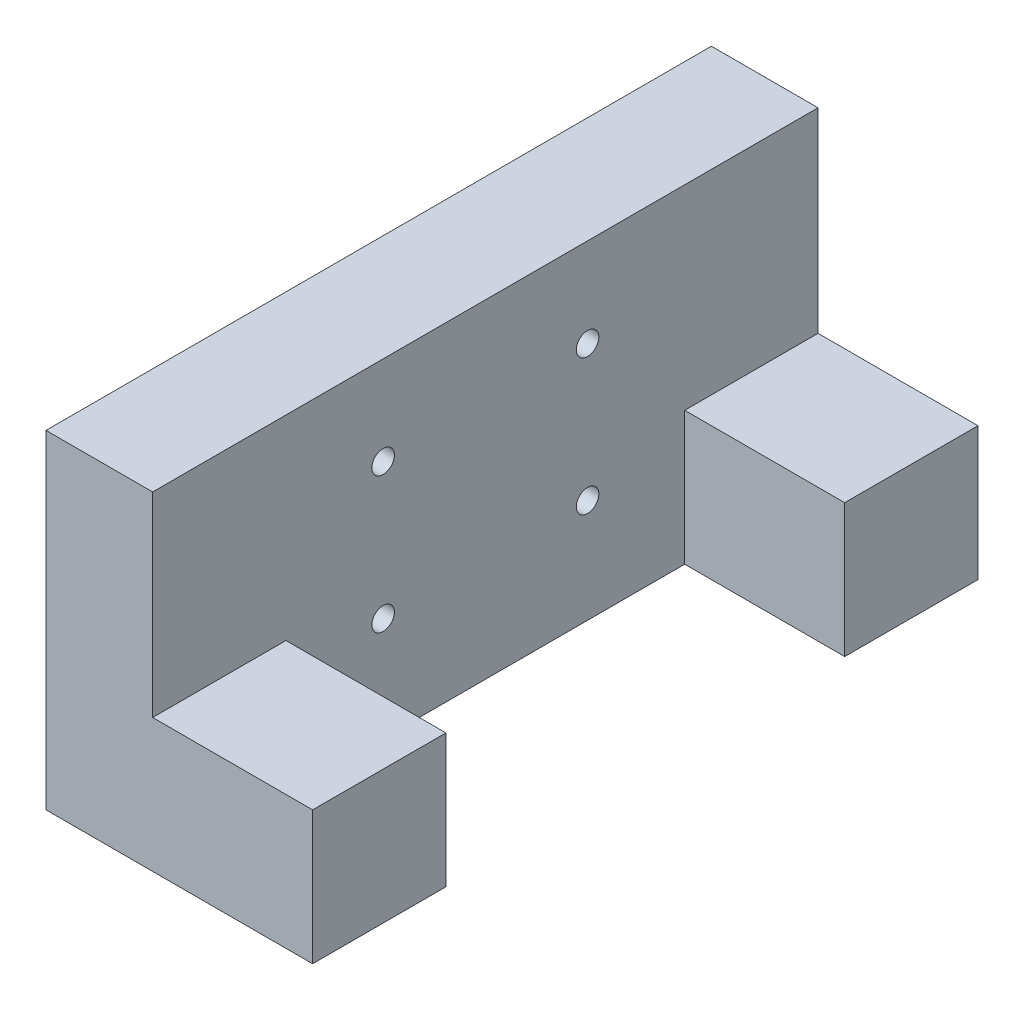
ISO-10303-21;
HEADER;
FILE_DESCRIPTION(('STEP AP214'),'2;1');
FILE_NAME('part.step','',(''),(''),'','','');
FILE_SCHEMA(('AUTOMOTIVE_DESIGN { 1 0 10303 214 1 1 1 1 }'));
ENDSEC;
DATA;
#1=APPLICATION_CONTEXT('core data for automotive mechanical design processes');
#2=APPLICATION_PROTOCOL_DEFINITION('international standard','automotive_design',2000,#1);
#3=PRODUCT_CONTEXT('',#1,'mechanical');
#4=PRODUCT('Part','Part','',(#3));
#5=PRODUCT_RELATED_PRODUCT_CATEGORY('part','',(#4));
#6=PRODUCT_DEFINITION_FORMATION('','',#4);
#7=PRODUCT_DEFINITION_CONTEXT('part definition',#1,'design');
#8=PRODUCT_DEFINITION('design','',#6,#7);
#9=PRODUCT_DEFINITION_SHAPE('','',#8);
#10=(LENGTH_UNIT() NAMED_UNIT(*) SI_UNIT(.MILLI.,.METRE.));
#11=(NAMED_UNIT(*) PLANE_ANGLE_UNIT() SI_UNIT($,.RADIAN.));
#12=(NAMED_UNIT(*) SI_UNIT($,.STERADIAN.) SOLID_ANGLE_UNIT());
#13=UNCERTAINTY_MEASURE_WITH_UNIT(LENGTH_MEASURE(1.E-05),#10,'distance_accuracy_value','');
#14=(GEOMETRIC_REPRESENTATION_CONTEXT(3) GLOBAL_UNCERTAINTY_ASSIGNED_CONTEXT((#13)) GLOBAL_UNIT_ASSIGNED_CONTEXT((#10,
#11,#12)) REPRESENTATION_CONTEXT('',''));
#15=CARTESIAN_POINT('',(0.,0.,0.));
#16=DIRECTION('',(0.,0.,1.));
#17=DIRECTION('',(1.,0.,0.));
#18=AXIS2_PLACEMENT_3D('',#15,#16,#17);
#19=CARTESIAN_POINT('',(35.0764508478614,0.,0.));
#20=DIRECTION('',(-1.,0.,0.));
#21=DIRECTION('',(0.,-1.,0.));
#22=AXIS2_PLACEMENT_3D('',#19,#20,#21);
#23=PLANE('',#22);
#24=CARTESIAN_POINT('',(35.0764508478611,-92.7759999999556,-271.868893693745));
#25=DIRECTION('',(1.,0.,0.));
#26=DIRECTION('',(0.,1.,0.));
#27=AXIS2_PLACEMENT_3D('',#24,#25,#26);
#28=CIRCLE('',#27,1.26999999999998);
#29=CARTESIAN_POINT('',(35.0764508478611,-91.5059999999556,-271.868893693745));
#30=VERTEX_POINT('',#29);
#31=EDGE_CURVE('E453',#30,#30,#28,.T.);
#32=ORIENTED_EDGE('',*,*,#31,.F.);
#33=EDGE_LOOP('',(#32));
#34=FACE_BOUND('',#33,.T.);
#35=CARTESIAN_POINT('',(35.076450847861,-77.4759999999556,-294.868893693745));
#36=DIRECTION('',(1.,0.,0.));
#37=DIRECTION('',(0.,1.,0.));
#38=AXIS2_PLACEMENT_3D('',#35,#36,#37);
#39=CIRCLE('',#38,1.26999999999998);
#40=CARTESIAN_POINT('',(35.076450847861,-76.2059999999556,-294.868893693745));
#41=VERTEX_POINT('',#40);
#42=EDGE_CURVE('E459',#41,#41,#39,.T.);
#43=ORIENTED_EDGE('',*,*,#42,.F.);
#44=EDGE_LOOP('',(#43));
#45=FACE_BOUND('',#44,.T.);
#46=CARTESIAN_POINT('',(35.076450847861,-92.7759999999556,-294.868893693745));
#47=DIRECTION('',(1.,0.,0.));
#48=DIRECTION('',(0.,1.,0.));
#49=AXIS2_PLACEMENT_3D('',#46,#47,#48);
#50=CIRCLE('',#49,1.26999999999998);
#51=CARTESIAN_POINT('',(35.076450847861,-91.5059999999556,-294.868893693745));
#52=VERTEX_POINT('',#51);
#53=EDGE_CURVE('E470',#52,#52,#50,.T.);
#54=ORIENTED_EDGE('',*,*,#53,.F.);
#55=EDGE_LOOP('',(#54));
#56=FACE_BOUND('',#55,.T.);
#57=CARTESIAN_POINT('',(35.076450847861,-77.4759999999556,-271.868893693745));
#58=DIRECTION('',(1.,0.,0.));
#59=DIRECTION('',(0.,1.,0.));
#60=AXIS2_PLACEMENT_3D('',#57,#58,#59);
#61=CIRCLE('',#60,1.26999999999998);
#62=CARTESIAN_POINT('',(35.076450847861,-76.2059999999556,-271.868893693745));
#63=VERTEX_POINT('',#62);
#64=EDGE_CURVE('E454',#63,#63,#61,.T.);
#65=ORIENTED_EDGE('',*,*,#64,.F.);
#66=EDGE_LOOP('',(#65));
#67=FACE_BOUND('',#66,.T.);
#68=DIRECTION('',(0.,0.,1.));
#69=VECTOR('',#68,1.);
#70=CARTESIAN_POINT('',(35.076450847861,-89.4560056897918,-320.804230830708));
#71=LINE('',#70,#69);
#72=CARTESIAN_POINT('',(35.076450847861,-89.4560056897918,-320.804230830708));
#73=VERTEX_POINT('',#72);
#74=CARTESIAN_POINT('',(35.076450847861,-89.4560056897918,-305.804230830708));
#75=VERTEX_POINT('',#74);
#76=EDGE_CURVE('E115',#73,#75,#71,.T.);
#77=ORIENTED_EDGE('',*,*,#76,.F.);
#78=DIRECTION('',(0.,-1.,0.));
#79=VECTOR('',#78,1.);
#80=CARTESIAN_POINT('',(35.0764508478609,-67.4759999999556,-320.804230830708));
#81=LINE('',#80,#79);
#82=CARTESIAN_POINT('',(35.0764508478609,-67.4759999999556,-320.804230830708));
#83=VERTEX_POINT('',#82);
#84=EDGE_CURVE('E182',#83,#73,#81,.T.);
#85=ORIENTED_EDGE('',*,*,#84,.F.);
#86=DIRECTION('',(0.,0.,-1.));
#87=VECTOR('',#86,1.);
#88=CARTESIAN_POINT('',(35.0764508478609,-67.4759999999556,-320.804230830708));
#89=LINE('',#88,#87);
#90=CARTESIAN_POINT('',(35.076450847861,-67.4759999999556,-245.933751171901));
#91=VERTEX_POINT('',#90);
#92=EDGE_CURVE('E180',#91,#83,#89,.T.);
#93=ORIENTED_EDGE('',*,*,#92,.F.);
#94=DIRECTION('',(0.,1.,0.));
#95=VECTOR('',#94,1.);
#96=CARTESIAN_POINT('',(35.076450847861,-67.4759999999556,-245.933751171901));
#97=LINE('',#96,#95);
#98=CARTESIAN_POINT('',(35.0764508478611,-89.4560056897918,-245.933751171901));
#99=VERTEX_POINT('',#98);
#100=EDGE_CURVE('E168',#99,#91,#97,.T.);
#101=ORIENTED_EDGE('',*,*,#100,.F.);
#102=DIRECTION('',(0.,0.,1.));
#103=VECTOR('',#102,1.);
#104=CARTESIAN_POINT('',(35.0764508478611,-89.4560056897918,-245.933751171901));
#105=LINE('',#104,#103);
#106=CARTESIAN_POINT('',(35.0764508478611,-89.4560056897918,-260.933751171901));
#107=VERTEX_POINT('',#106);
#108=EDGE_CURVE('E149',#107,#99,#105,.T.);
#109=ORIENTED_EDGE('',*,*,#108,.F.);
#110=DIRECTION('',(0.,1.,0.));
#111=VECTOR('',#110,1.);
#112=CARTESIAN_POINT('',(35.0764508478611,-104.456005689792,-260.933751171901));
#113=LINE('',#112,#111);
#114=CARTESIAN_POINT('',(35.0764508478611,-104.456005689792,-260.933751171901));
#115=VERTEX_POINT('',#114);
#116=EDGE_CURVE('E126',#115,#107,#113,.T.);
#117=ORIENTED_EDGE('',*,*,#116,.F.);
#118=DIRECTION('',(0.,0.,1.));
#119=VECTOR('',#118,1.);
#120=CARTESIAN_POINT('',(35.076450847861,-104.456005689792,-320.804230830708));
#121=LINE('',#120,#119);
#122=CARTESIAN_POINT('',(35.076450847861,-104.456005689792,-305.804230830708));
#123=VERTEX_POINT('',#122);
#124=EDGE_CURVE('E57',#123,#115,#121,.T.);
#125=ORIENTED_EDGE('',*,*,#124,.F.);
#126=DIRECTION('',(0.,-1.,0.));
#127=VECTOR('',#126,1.);
#128=CARTESIAN_POINT('',(35.076450847861,-104.456005689792,-305.804230830708));
#129=LINE('',#128,#127);
#130=EDGE_CURVE('E127',#75,#123,#129,.T.);
#131=ORIENTED_EDGE('',*,*,#130,.F.);
#132=EDGE_LOOP('',(#77,#85,#93,#101,#109,#117,#125,#131));
#133=FACE_BOUND('',#132,.T.);
#134=ADVANCED_FACE('F37',(#34,#45,#56,#67,#133),#23,.F.);
#135=CARTESIAN_POINT('',(23.076450847861,-67.4759999999556,-245.933751171901));
#136=DIRECTION('',(0.,0.,-1.));
#137=DIRECTION('',(-1.,0.,0.));
#138=AXIS2_PLACEMENT_3D('',#135,#136,#137);
#139=PLANE('',#138);
#140=DIRECTION('',(1.,0.,0.));
#141=VECTOR('',#140,1.);
#142=CARTESIAN_POINT('',(23.0764508478611,-104.456005689792,-245.933751171901));
#143=LINE('',#142,#141);
#144=CARTESIAN_POINT('',(23.0764508478611,-104.456005689792,-245.933751171901));
#145=VERTEX_POINT('',#144);
#146=CARTESIAN_POINT('',(53.0764508478611,-104.456005689792,-245.933751171901));
#147=VERTEX_POINT('',#146);
#148=EDGE_CURVE('E178',#145,#147,#143,.T.);
#149=ORIENTED_EDGE('',*,*,#148,.T.);
#150=DIRECTION('',(0.,-1.,0.));
#151=VECTOR('',#150,1.);
#152=CARTESIAN_POINT('',(53.0764508478611,-104.456005689792,-245.933751171901));
#153=LINE('',#152,#151);
#154=CARTESIAN_POINT('',(53.0764508478611,-89.4560056897918,-245.933751171901));
#155=VERTEX_POINT('',#154);
#156=EDGE_CURVE('E145',#155,#147,#153,.T.);
#157=ORIENTED_EDGE('',*,*,#156,.F.);
#158=DIRECTION('',(-1.,0.,0.));
#159=VECTOR('',#158,1.);
#160=CARTESIAN_POINT('',(53.0764508478611,-89.4560056897918,-245.933751171901));
#161=LINE('',#160,#159);
#162=EDGE_CURVE('E155',#155,#99,#161,.T.);
#163=ORIENTED_EDGE('',*,*,#162,.T.);
#164=ORIENTED_EDGE('',*,*,#100,.T.);
#165=DIRECTION('',(1.,0.,0.));
#166=VECTOR('',#165,1.);
#167=CARTESIAN_POINT('',(23.076450847861,-67.4759999999556,-245.933751171901));
#168=LINE('',#167,#166);
#169=CARTESIAN_POINT('',(23.076450847861,-67.4759999999556,-245.933751171901));
#170=VERTEX_POINT('',#169);
#171=EDGE_CURVE('E11',#170,#91,#168,.T.);
#172=ORIENTED_EDGE('',*,*,#171,.F.);
#173=DIRECTION('',(0.,1.,0.));
#174=VECTOR('',#173,1.);
#175=CARTESIAN_POINT('',(23.076450847861,-67.4759999999556,-245.933751171901));
#176=LINE('',#175,#174);
#177=EDGE_CURVE('E169',#145,#170,#176,.T.);
#178=ORIENTED_EDGE('',*,*,#177,.F.);
#179=EDGE_LOOP('',(#149,#157,#163,#164,#172,#178));
#180=FACE_BOUND('',#179,.T.);
#181=ADVANCED_FACE('F39',(#180),#139,.F.);
#182=CARTESIAN_POINT('',(23.0764508478609,-67.4759999999556,-320.804230830708));
#183=DIRECTION('',(0.,-1.,0.));
#184=DIRECTION('',(1.,0.,0.));
#185=AXIS2_PLACEMENT_3D('',#182,#183,#184);
#186=PLANE('',#185);
#187=ORIENTED_EDGE('',*,*,#92,.T.);
#188=DIRECTION('',(1.,0.,0.));
#189=VECTOR('',#188,1.);
#190=CARTESIAN_POINT('',(23.0764508478609,-67.4759999999556,-320.804230830708));
#191=LINE('',#190,#189);
#192=CARTESIAN_POINT('',(23.0764508478609,-67.4759999999556,-320.804230830708));
#193=VERTEX_POINT('',#192);
#194=EDGE_CURVE('E45',#193,#83,#191,.T.);
#195=ORIENTED_EDGE('',*,*,#194,.F.);
#196=DIRECTION('',(0.,0.,-1.));
#197=VECTOR('',#196,1.);
#198=CARTESIAN_POINT('',(23.0764508478609,-67.4759999999556,-320.804230830708));
#199=LINE('',#198,#197);
#200=EDGE_CURVE('E172',#170,#193,#199,.T.);
#201=ORIENTED_EDGE('',*,*,#200,.F.);
#202=ORIENTED_EDGE('',*,*,#171,.T.);
#203=EDGE_LOOP('',(#187,#195,#201,#202));
#204=FACE_BOUND('',#203,.T.);
#205=ADVANCED_FACE('F196',(#204),#186,.F.);
#206=CARTESIAN_POINT('',(23.0764508478609,-67.4759999999556,-320.804230830708));
#207=DIRECTION('',(0.,0.,1.));
#208=DIRECTION('',(1.,0.,0.));
#209=AXIS2_PLACEMENT_3D('',#206,#207,#208);
#210=PLANE('',#209);
#211=ORIENTED_EDGE('',*,*,#84,.T.);
#212=DIRECTION('',(-1.,0.,0.));
#213=VECTOR('',#212,1.);
#214=CARTESIAN_POINT('',(53.076450847861,-89.4560056897918,-320.804230830708));
#215=LINE('',#214,#213);
#216=CARTESIAN_POINT('',(53.076450847861,-89.4560056897918,-320.804230830708));
#217=VERTEX_POINT('',#216);
#218=EDGE_CURVE('E121',#217,#73,#215,.T.);
#219=ORIENTED_EDGE('',*,*,#218,.F.);
#220=DIRECTION('',(0.,1.,0.));
#221=VECTOR('',#220,1.);
#222=CARTESIAN_POINT('',(53.076450847861,-104.456005689792,-320.804230830708));
#223=LINE('',#222,#221);
#224=CARTESIAN_POINT('',(53.076450847861,-104.456005689792,-320.804230830708));
#225=VERTEX_POINT('',#224);
#226=EDGE_CURVE('E133',#225,#217,#223,.T.);
#227=ORIENTED_EDGE('',*,*,#226,.F.);
#228=DIRECTION('',(1.,0.,0.));
#229=VECTOR('',#228,1.);
#230=CARTESIAN_POINT('',(23.076450847861,-104.456005689792,-320.804230830708));
#231=LINE('',#230,#229);
#232=CARTESIAN_POINT('',(23.076450847861,-104.456005689792,-320.804230830708));
#233=VERTEX_POINT('',#232);
#234=EDGE_CURVE('E186',#233,#225,#231,.T.);
#235=ORIENTED_EDGE('',*,*,#234,.F.);
#236=DIRECTION('',(0.,-1.,0.));
#237=VECTOR('',#236,1.);
#238=CARTESIAN_POINT('',(23.0764508478609,-67.4759999999556,-320.804230830708));
#239=LINE('',#238,#237);
#240=EDGE_CURVE('E174',#193,#233,#239,.T.);
#241=ORIENTED_EDGE('',*,*,#240,.F.);
#242=ORIENTED_EDGE('',*,*,#194,.T.);
#243=EDGE_LOOP('',(#211,#219,#227,#235,#241,#242));
#244=FACE_BOUND('',#243,.T.);
#245=ADVANCED_FACE('F191',(#244),#210,.F.);
#246=CARTESIAN_POINT('',(23.076450847861,-104.456005689792,-320.804230830708));
#247=DIRECTION('',(0.,1.,0.));
#248=DIRECTION('',(-1.,0.,0.));
#249=AXIS2_PLACEMENT_3D('',#246,#247,#248);
#250=PLANE('',#249);
#251=CARTESIAN_POINT('',(46.0264508482652,-104.456005689792,-253.724999999956));
#252=DIRECTION('',(0.,-1.,0.));
#253=DIRECTION('',(1.,0.,0.));
#254=AXIS2_PLACEMENT_3D('',#251,#252,#253);
#255=CIRCLE('',#254,4.07500000002037);
#256=CARTESIAN_POINT('',(50.1014508482855,-104.456005689792,-253.724999999956));
#257=VERTEX_POINT('',#256);
#258=EDGE_CURVE('E477',#257,#257,#255,.T.);
#259=ORIENTED_EDGE('',*,*,#258,.F.);
#260=EDGE_LOOP('',(#259));
#261=FACE_BOUND('',#260,.T.);
#262=CARTESIAN_POINT('',(46.0264508482652,-104.456005689792,-313.012982002653));
#263=DIRECTION('',(0.,-1.,0.));
#264=DIRECTION('',(-1.,0.,0.));
#265=AXIS2_PLACEMENT_3D('',#262,#263,#264);
#266=CIRCLE('',#265,4.07500000004585);
#267=CARTESIAN_POINT('',(41.9514508482193,-104.456005689792,-313.012982002653));
#268=VERTEX_POINT('',#267);
#269=EDGE_CURVE('E480',#268,#268,#266,.T.);
#270=ORIENTED_EDGE('',*,*,#269,.F.);
#271=EDGE_LOOP('',(#270));
#272=FACE_BOUND('',#271,.T.);
#273=ORIENTED_EDGE('',*,*,#234,.T.);
#274=DIRECTION('',(0.,0.,-1.));
#275=VECTOR('',#274,1.);
#276=CARTESIAN_POINT('',(53.076450847861,-104.456005689792,-320.804230830708));
#277=LINE('',#276,#275);
#278=CARTESIAN_POINT('',(53.076450847861,-104.456005689792,-305.804230830708));
#279=VERTEX_POINT('',#278);
#280=EDGE_CURVE('E140',#279,#225,#277,.T.);
#281=ORIENTED_EDGE('',*,*,#280,.F.);
#282=DIRECTION('',(-1.,0.,0.));
#283=VECTOR('',#282,1.);
#284=CARTESIAN_POINT('',(53.076450847861,-104.456005689792,-305.804230830708));
#285=LINE('',#284,#283);
#286=EDGE_CURVE('E52',#279,#123,#285,.T.);
#287=ORIENTED_EDGE('',*,*,#286,.T.);
#288=ORIENTED_EDGE('',*,*,#124,.T.);
#289=DIRECTION('',(-1.,0.,0.));
#290=VECTOR('',#289,1.);
#291=CARTESIAN_POINT('',(53.0764508478611,-104.456005689792,-260.933751171901));
#292=LINE('',#291,#290);
#293=CARTESIAN_POINT('',(53.0764508478611,-104.456005689792,-260.933751171901));
#294=VERTEX_POINT('',#293);
#295=EDGE_CURVE('E165',#294,#115,#292,.T.);
#296=ORIENTED_EDGE('',*,*,#295,.F.);
#297=DIRECTION('',(0.,0.,-1.));
#298=VECTOR('',#297,1.);
#299=CARTESIAN_POINT('',(53.0764508478611,-104.456005689792,-245.933751171901));
#300=LINE('',#299,#298);
#301=EDGE_CURVE('E148',#147,#294,#300,.T.);
#302=ORIENTED_EDGE('',*,*,#301,.F.);
#303=ORIENTED_EDGE('',*,*,#148,.F.);
#304=DIRECTION('',(0.,0.,1.));
#305=VECTOR('',#304,1.);
#306=CARTESIAN_POINT('',(23.076450847861,-104.456005689792,-320.804230830708));
#307=LINE('',#306,#305);
#308=EDGE_CURVE('E176',#233,#145,#307,.T.);
#309=ORIENTED_EDGE('',*,*,#308,.F.);
#310=EDGE_LOOP('',(#273,#281,#287,#288,#296,#302,#303,#309));
#311=FACE_BOUND('',#310,.T.);
#312=ADVANCED_FACE('F209',(#261,#272,#311),#250,.F.);
#313=CARTESIAN_POINT('',(23.0764508478614,0.,0.));
#314=DIRECTION('',(-1.,0.,0.));
#315=DIRECTION('',(0.,-1.,0.));
#316=AXIS2_PLACEMENT_3D('',#313,#314,#315);
#317=PLANE('',#316);
#318=CARTESIAN_POINT('',(23.0764508478608,-92.7759999999556,-271.868893693745));
#319=DIRECTION('',(1.,0.,0.));
#320=DIRECTION('',(0.,1.,0.));
#321=AXIS2_PLACEMENT_3D('',#318,#319,#320);
#322=CIRCLE('',#321,1.26999999999998);
#323=CARTESIAN_POINT('',(23.0764508478608,-91.5059999999556,-271.868893693745));
#324=VERTEX_POINT('',#323);
#325=EDGE_CURVE('E451',#324,#324,#322,.T.);
#326=ORIENTED_EDGE('',*,*,#325,.T.);
#327=EDGE_LOOP('',(#326));
#328=FACE_BOUND('',#327,.T.);
#329=CARTESIAN_POINT('',(23.0764508478608,-77.4759999999556,-294.868893693745));
#330=DIRECTION('',(1.,0.,0.));
#331=DIRECTION('',(0.,1.,0.));
#332=AXIS2_PLACEMENT_3D('',#329,#330,#331);
#333=CIRCLE('',#332,1.26999999999998);
#334=CARTESIAN_POINT('',(23.0764508478607,-76.2059999999556,-294.868893693745));
#335=VERTEX_POINT('',#334);
#336=EDGE_CURVE('E467',#335,#335,#333,.T.);
#337=ORIENTED_EDGE('',*,*,#336,.T.);
#338=EDGE_LOOP('',(#337));
#339=FACE_BOUND('',#338,.T.);
#340=CARTESIAN_POINT('',(23.0764508478608,-92.7759999999556,-294.868893693745));
#341=DIRECTION('',(1.,0.,0.));
#342=DIRECTION('',(0.,1.,0.));
#343=AXIS2_PLACEMENT_3D('',#340,#341,#342);
#344=CIRCLE('',#343,1.26999999999998);
#345=CARTESIAN_POINT('',(23.0764508478608,-91.5059999999556,-294.868893693745));
#346=VERTEX_POINT('',#345);
#347=EDGE_CURVE('E462',#346,#346,#344,.T.);
#348=ORIENTED_EDGE('',*,*,#347,.T.);
#349=EDGE_LOOP('',(#348));
#350=FACE_BOUND('',#349,.T.);
#351=CARTESIAN_POINT('',(23.0764508478608,-77.4759999999556,-271.868893693745));
#352=DIRECTION('',(1.,0.,0.));
#353=DIRECTION('',(0.,1.,0.));
#354=AXIS2_PLACEMENT_3D('',#351,#352,#353);
#355=CIRCLE('',#354,1.26999999999998);
#356=CARTESIAN_POINT('',(23.0764508478608,-76.2059999999556,-271.868893693745));
#357=VERTEX_POINT('',#356);
#358=EDGE_CURVE('E457',#357,#357,#355,.T.);
#359=ORIENTED_EDGE('',*,*,#358,.T.);
#360=EDGE_LOOP('',(#359));
#361=FACE_BOUND('',#360,.T.);
#362=ORIENTED_EDGE('',*,*,#177,.T.);
#363=ORIENTED_EDGE('',*,*,#200,.T.);
#364=ORIENTED_EDGE('',*,*,#240,.T.);
#365=ORIENTED_EDGE('',*,*,#308,.T.);
#366=EDGE_LOOP('',(#362,#363,#364,#365));
#367=FACE_BOUND('',#366,.T.);
#368=ADVANCED_FACE('F233',(#328,#339,#350,#361,#367),#317,.T.);
#369=CARTESIAN_POINT('',(53.0764508478611,-104.456005689792,-260.933751171901));
#370=DIRECTION('',(0.,0.,1.));
#371=DIRECTION('',(1.,0.,0.));
#372=AXIS2_PLACEMENT_3D('',#369,#370,#371);
#373=PLANE('',#372);
#374=ORIENTED_EDGE('',*,*,#116,.T.);
#375=DIRECTION('',(-1.,0.,0.));
#376=VECTOR('',#375,1.);
#377=CARTESIAN_POINT('',(53.0764508478611,-89.4560056897918,-260.933751171901));
#378=LINE('',#377,#376);
#379=CARTESIAN_POINT('',(53.0764508478611,-89.4560056897918,-260.933751171901));
#380=VERTEX_POINT('',#379);
#381=EDGE_CURVE('E162',#380,#107,#378,.T.);
#382=ORIENTED_EDGE('',*,*,#381,.F.);
#383=DIRECTION('',(0.,1.,0.));
#384=VECTOR('',#383,1.);
#385=CARTESIAN_POINT('',(53.0764508478611,-104.456005689792,-260.933751171901));
#386=LINE('',#385,#384);
#387=EDGE_CURVE('E151',#294,#380,#386,.T.);
#388=ORIENTED_EDGE('',*,*,#387,.F.);
#389=ORIENTED_EDGE('',*,*,#295,.T.);
#390=EDGE_LOOP('',(#374,#382,#388,#389));
#391=FACE_BOUND('',#390,.T.);
#392=ADVANCED_FACE('F206',(#391),#373,.F.);
#393=CARTESIAN_POINT('',(53.0764508478611,-89.4560056897918,-245.933751171901));
#394=DIRECTION('',(0.,-1.,0.));
#395=DIRECTION('',(1.,0.,0.));
#396=AXIS2_PLACEMENT_3D('',#393,#394,#395);
#397=PLANE('',#396);
#398=ORIENTED_EDGE('',*,*,#108,.T.);
#399=ORIENTED_EDGE('',*,*,#162,.F.);
#400=DIRECTION('',(0.,0.,1.));
#401=VECTOR('',#400,1.);
#402=CARTESIAN_POINT('',(53.0764508478611,-89.4560056897918,-245.933751171901));
#403=LINE('',#402,#401);
#404=EDGE_CURVE('E153',#380,#155,#403,.T.);
#405=ORIENTED_EDGE('',*,*,#404,.F.);
#406=ORIENTED_EDGE('',*,*,#381,.T.);
#407=EDGE_LOOP('',(#398,#399,#405,#406));
#408=FACE_BOUND('',#407,.T.);
#409=ADVANCED_FACE('F203',(#408),#397,.F.);
#410=CARTESIAN_POINT('',(53.0764508478613,1.20022975107335E-13,0.));
#411=DIRECTION('',(-1.,0.,0.));
#412=DIRECTION('',(0.,-1.,0.));
#413=AXIS2_PLACEMENT_3D('',#410,#411,#412);
#414=PLANE('',#413);
#415=ORIENTED_EDGE('',*,*,#156,.T.);
#416=ORIENTED_EDGE('',*,*,#301,.T.);
#417=ORIENTED_EDGE('',*,*,#387,.T.);
#418=ORIENTED_EDGE('',*,*,#404,.T.);
#419=EDGE_LOOP('',(#415,#416,#417,#418));
#420=FACE_BOUND('',#419,.T.);
#421=ADVANCED_FACE('F213',(#420),#414,.F.);
#422=CARTESIAN_POINT('',(53.076450847861,-89.4560056897918,-320.804230830708));
#423=DIRECTION('',(0.,-1.,0.));
#424=DIRECTION('',(1.,0.,0.));
#425=AXIS2_PLACEMENT_3D('',#422,#423,#424);
#426=PLANE('',#425);
#427=ORIENTED_EDGE('',*,*,#76,.T.);
#428=DIRECTION('',(-1.,0.,0.));
#429=VECTOR('',#428,1.);
#430=CARTESIAN_POINT('',(53.076450847861,-89.4560056897918,-305.804230830708));
#431=LINE('',#430,#429);
#432=CARTESIAN_POINT('',(53.076450847861,-89.4560056897918,-305.804230830708));
#433=VERTEX_POINT('',#432);
#434=EDGE_CURVE('E118',#433,#75,#431,.T.);
#435=ORIENTED_EDGE('',*,*,#434,.F.);
#436=DIRECTION('',(0.,0.,1.));
#437=VECTOR('',#436,1.);
#438=CARTESIAN_POINT('',(53.076450847861,-89.4560056897918,-320.804230830708));
#439=LINE('',#438,#437);
#440=EDGE_CURVE('E136',#217,#433,#439,.T.);
#441=ORIENTED_EDGE('',*,*,#440,.F.);
#442=ORIENTED_EDGE('',*,*,#218,.T.);
#443=EDGE_LOOP('',(#427,#435,#441,#442));
#444=FACE_BOUND('',#443,.T.);
#445=ADVANCED_FACE('F117',(#444),#426,.F.);
#446=CARTESIAN_POINT('',(53.076450847861,-104.456005689792,-305.804230830708));
#447=DIRECTION('',(0.,0.,-1.));
#448=DIRECTION('',(-1.,0.,0.));
#449=AXIS2_PLACEMENT_3D('',#446,#447,#448);
#450=PLANE('',#449);
#451=ORIENTED_EDGE('',*,*,#130,.T.);
#452=ORIENTED_EDGE('',*,*,#286,.F.);
#453=DIRECTION('',(0.,-1.,0.));
#454=VECTOR('',#453,1.);
#455=CARTESIAN_POINT('',(53.076450847861,-104.456005689792,-305.804230830708));
#456=LINE('',#455,#454);
#457=EDGE_CURVE('E131',#433,#279,#456,.T.);
#458=ORIENTED_EDGE('',*,*,#457,.F.);
#459=ORIENTED_EDGE('',*,*,#434,.T.);
#460=EDGE_LOOP('',(#451,#452,#458,#459));
#461=FACE_BOUND('',#460,.T.);
#462=ADVANCED_FACE('F130',(#461),#450,.F.);
#463=CARTESIAN_POINT('',(53.0764508478613,1.20022975107335E-13,0.));
#464=DIRECTION('',(1.,0.,0.));
#465=DIRECTION('',(0.,1.,0.));
#466=AXIS2_PLACEMENT_3D('',#463,#464,#465);
#467=PLANE('',#466);
#468=ORIENTED_EDGE('',*,*,#226,.T.);
#469=ORIENTED_EDGE('',*,*,#440,.T.);
#470=ORIENTED_EDGE('',*,*,#457,.T.);
#471=ORIENTED_EDGE('',*,*,#280,.T.);
#472=EDGE_LOOP('',(#468,#469,#470,#471));
#473=FACE_BOUND('',#472,.T.);
#474=ADVANCED_FACE('F291',(#473),#467,.T.);
#475=CARTESIAN_POINT('',(46.0264508482651,-92.4560056897918,-313.012982002653));
#476=DIRECTION('',(0.,-1.,0.));
#477=DIRECTION('',(1.,0.,0.));
#478=AXIS2_PLACEMENT_3D('',#475,#476,#477);
#479=CYLINDRICAL_SURFACE('',#478,4.07500000004585);
#480=CARTESIAN_POINT('',(46.0264508482651,-92.4560056897918,-313.012982002653));
#481=DIRECTION('',(0.,-1.,0.));
#482=DIRECTION('',(-1.,0.,0.));
#483=AXIS2_PLACEMENT_3D('',#480,#481,#482);
#484=CIRCLE('',#483,4.07500000004585);
#485=CARTESIAN_POINT('',(41.9514508482193,-92.4560056897918,-313.012982002653));
#486=VERTEX_POINT('',#485);
#487=EDGE_CURVE('E472',#486,#486,#484,.T.);
#488=ORIENTED_EDGE('',*,*,#487,.F.);
#489=EDGE_LOOP('',(#488));
#490=FACE_BOUND('',#489,.T.);
#491=ORIENTED_EDGE('',*,*,#269,.T.);
#492=EDGE_LOOP('',(#491));
#493=FACE_BOUND('',#492,.T.);
#494=ADVANCED_FACE('F300',(#490,#493),#479,.F.);
#495=CARTESIAN_POINT('',(46.0264508482651,-92.4560056897918,-313.012982002653));
#496=DIRECTION('',(0.,1.,0.));
#497=DIRECTION('',(-1.,0.,0.));
#498=AXIS2_PLACEMENT_3D('',#495,#496,#497);
#499=PLANE('',#498);
#500=ORIENTED_EDGE('',*,*,#487,.T.);
#501=EDGE_LOOP('',(#500));
#502=FACE_BOUND('',#501,.T.);
#503=ADVANCED_FACE('F310',(#502),#499,.F.);
#504=CARTESIAN_POINT('',(46.0264508482651,-92.4560056897918,-253.724999999956));
#505=DIRECTION('',(0.,-1.,0.));
#506=DIRECTION('',(1.,0.,0.));
#507=AXIS2_PLACEMENT_3D('',#504,#505,#506);
#508=CYLINDRICAL_SURFACE('',#507,4.07500000002037);
#509=CARTESIAN_POINT('',(46.0264508482651,-92.4560056897918,-253.724999999956));
#510=DIRECTION('',(0.,-1.,0.));
#511=DIRECTION('',(1.,0.,0.));
#512=AXIS2_PLACEMENT_3D('',#509,#510,#511);
#513=CIRCLE('',#512,4.07500000002037);
#514=CARTESIAN_POINT('',(50.1014508482855,-92.4560056897918,-253.724999999956));
#515=VERTEX_POINT('',#514);
#516=EDGE_CURVE('E474',#515,#515,#513,.T.);
#517=ORIENTED_EDGE('',*,*,#516,.F.);
#518=EDGE_LOOP('',(#517));
#519=FACE_BOUND('',#518,.T.);
#520=ORIENTED_EDGE('',*,*,#258,.T.);
#521=EDGE_LOOP('',(#520));
#522=FACE_BOUND('',#521,.T.);
#523=ADVANCED_FACE('F317',(#519,#522),#508,.F.);
#524=CARTESIAN_POINT('',(46.0264508482651,-92.4560056897918,-253.724999999956));
#525=DIRECTION('',(0.,-1.,0.));
#526=DIRECTION('',(1.,0.,0.));
#527=AXIS2_PLACEMENT_3D('',#524,#525,#526);
#528=PLANE('',#527);
#529=ORIENTED_EDGE('',*,*,#516,.T.);
#530=EDGE_LOOP('',(#529));
#531=FACE_BOUND('',#530,.T.);
#532=ADVANCED_FACE('F325',(#531),#528,.T.);
#533=CARTESIAN_POINT('',(23.0764508478608,-77.4759999999556,-271.868893693745));
#534=DIRECTION('',(1.,0.,0.));
#535=DIRECTION('',(0.,1.,0.));
#536=AXIS2_PLACEMENT_3D('',#533,#534,#535);
#537=CYLINDRICAL_SURFACE('',#536,1.26999999999998);
#538=ORIENTED_EDGE('',*,*,#358,.F.);
#539=EDGE_LOOP('',(#538));
#540=FACE_BOUND('',#539,.T.);
#541=ORIENTED_EDGE('',*,*,#64,.T.);
#542=EDGE_LOOP('',(#541));
#543=FACE_BOUND('',#542,.T.);
#544=ADVANCED_FACE('F333',(#540,#543),#537,.F.);
#545=CARTESIAN_POINT('',(23.0764508478608,-92.7759999999556,-294.868893693745));
#546=DIRECTION('',(1.,0.,0.));
#547=DIRECTION('',(0.,1.,0.));
#548=AXIS2_PLACEMENT_3D('',#545,#546,#547);
#549=CYLINDRICAL_SURFACE('',#548,1.26999999999998);
#550=ORIENTED_EDGE('',*,*,#347,.F.);
#551=EDGE_LOOP('',(#550));
#552=FACE_BOUND('',#551,.T.);
#553=ORIENTED_EDGE('',*,*,#53,.T.);
#554=EDGE_LOOP('',(#553));
#555=FACE_BOUND('',#554,.T.);
#556=ADVANCED_FACE('F340',(#552,#555),#549,.F.);
#557=CARTESIAN_POINT('',(23.0764508478608,-77.4759999999556,-294.868893693745));
#558=DIRECTION('',(1.,0.,0.));
#559=DIRECTION('',(0.,1.,0.));
#560=AXIS2_PLACEMENT_3D('',#557,#558,#559);
#561=CYLINDRICAL_SURFACE('',#560,1.26999999999998);
#562=ORIENTED_EDGE('',*,*,#336,.F.);
#563=EDGE_LOOP('',(#562));
#564=FACE_BOUND('',#563,.T.);
#565=ORIENTED_EDGE('',*,*,#42,.T.);
#566=EDGE_LOOP('',(#565));
#567=FACE_BOUND('',#566,.T.);
#568=ADVANCED_FACE('F348',(#564,#567),#561,.F.);
#569=CARTESIAN_POINT('',(23.0764508478608,-92.7759999999556,-271.868893693745));
#570=DIRECTION('',(1.,0.,0.));
#571=DIRECTION('',(0.,1.,0.));
#572=AXIS2_PLACEMENT_3D('',#569,#570,#571);
#573=CYLINDRICAL_SURFACE('',#572,1.26999999999998);
#574=ORIENTED_EDGE('',*,*,#325,.F.);
#575=EDGE_LOOP('',(#574));
#576=FACE_BOUND('',#575,.T.);
#577=ORIENTED_EDGE('',*,*,#31,.T.);
#578=EDGE_LOOP('',(#577));
#579=FACE_BOUND('',#578,.T.);
#580=ADVANCED_FACE('F356',(#576,#579),#573,.F.);
#581=CLOSED_SHELL('',(#134,#181,#205,#245,#312,#368,#392,#409,#421,#445,#462,#474,#494,#503,
#523,#532,#544,#556,#568,#580));
#582=MANIFOLD_SOLID_BREP('B2',#581);
#583=ADVANCED_BREP_SHAPE_REPRESENTATION('',(#18,#582),#14);
#584=SHAPE_DEFINITION_REPRESENTATION(#9,#583);
ENDSEC;
END-ISO-10303-21;
